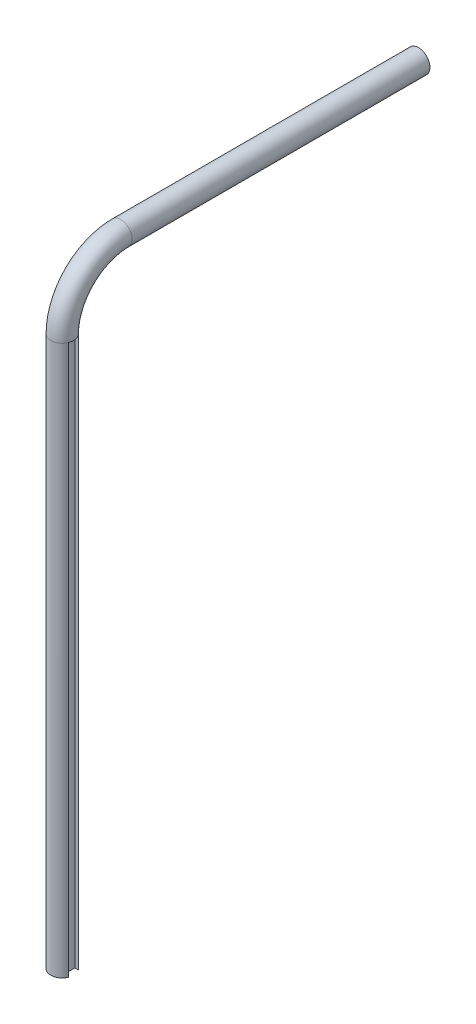
ISO-10303-21;
HEADER;
FILE_DESCRIPTION(('STEP AP214'),'2;1');
FILE_NAME('part.step','',(''),(''),'','','');
FILE_SCHEMA(('AUTOMOTIVE_DESIGN { 1 0 10303 214 1 1 1 1 }'));
ENDSEC;
DATA;
#1=APPLICATION_CONTEXT('core data for automotive mechanical design processes');
#2=APPLICATION_PROTOCOL_DEFINITION('international standard','automotive_design',2000,#1);
#3=PRODUCT_CONTEXT('',#1,'mechanical');
#4=PRODUCT('Part','Part','',(#3));
#5=PRODUCT_RELATED_PRODUCT_CATEGORY('part','',(#4));
#6=PRODUCT_DEFINITION_FORMATION('','',#4);
#7=PRODUCT_DEFINITION_CONTEXT('part definition',#1,'design');
#8=PRODUCT_DEFINITION('design','',#6,#7);
#9=PRODUCT_DEFINITION_SHAPE('','',#8);
#10=(LENGTH_UNIT() NAMED_UNIT(*) SI_UNIT(.MILLI.,.METRE.));
#11=(NAMED_UNIT(*) PLANE_ANGLE_UNIT() SI_UNIT($,.RADIAN.));
#12=(NAMED_UNIT(*) SI_UNIT($,.STERADIAN.) SOLID_ANGLE_UNIT());
#13=UNCERTAINTY_MEASURE_WITH_UNIT(LENGTH_MEASURE(1.E-05),#10,'distance_accuracy_value','');
#14=(GEOMETRIC_REPRESENTATION_CONTEXT(3) GLOBAL_UNCERTAINTY_ASSIGNED_CONTEXT((#13)) GLOBAL_UNIT_ASSIGNED_CONTEXT((#10,
#11,#12)) REPRESENTATION_CONTEXT('',''));
#15=CARTESIAN_POINT('',(0.,0.,0.));
#16=DIRECTION('',(0.,0.,1.));
#17=DIRECTION('',(1.,0.,0.));
#18=AXIS2_PLACEMENT_3D('',#15,#16,#17);
#19=CARTESIAN_POINT('',(0.,0.,0.));
#20=DIRECTION('',(-1.,0.,0.));
#21=DIRECTION('',(0.,0.,1.));
#22=AXIS2_PLACEMENT_3D('',#19,#20,#21);
#23=TOROIDAL_SURFACE('',#22,64.833774641659,12.7);
#24=CARTESIAN_POINT('',(0.,64.833774641659,0.));
#25=DIRECTION('',(0.,0.,-1.));
#26=DIRECTION('',(0.,1.,0.));
#27=AXIS2_PLACEMENT_3D('',#24,#25,#26);
#28=CIRCLE('',#27,12.7);
#29=CARTESIAN_POINT('',(0.,77.533774641659,0.));
#30=VERTEX_POINT('',#29);
#31=EDGE_CURVE('E132',#30,#30,#28,.T.);
#32=ORIENTED_EDGE('',*,*,#31,.F.);
#33=EDGE_LOOP('',(#32));
#34=FACE_BOUND('',#33,.T.);
#35=CARTESIAN_POINT('',(0.,0.,64.833774641659));
#36=DIRECTION('',(0.,-1.,0.));
#37=DIRECTION('',(0.,0.,-1.));
#38=AXIS2_PLACEMENT_3D('',#35,#36,#37);
#39=CIRCLE('',#38,12.7);
#40=CARTESIAN_POINT('',(10.1118547881285,0.,57.15));
#41=VERTEX_POINT('',#40);
#42=CARTESIAN_POINT('',(11.6673683045637,0.,69.85));
#43=VERTEX_POINT('',#42);
#44=EDGE_CURVE('E70',#41,#43,#39,.T.);
#45=ORIENTED_EDGE('',*,*,#44,.F.);
#46=EDGE_CURVE('E129',#43,#41,#39,.T.);
#47=ORIENTED_EDGE('',*,*,#46,.F.);
#48=EDGE_LOOP('',(#45,#47));
#49=FACE_BOUND('',#48,.T.);
#50=ADVANCED_FACE('F48',(#34,#49),#23,.T.);
#51=CARTESIAN_POINT('',(0.,0.,0.));
#52=DIRECTION('',(-1.,0.,0.));
#53=DIRECTION('',(0.,0.,1.));
#54=AXIS2_PLACEMENT_3D('',#51,#52,#53);
#55=TOROIDAL_SURFACE('',#54,64.833774641659,4.7625);
#56=CARTESIAN_POINT('',(0.,0.,64.833774641659));
#57=DIRECTION('',(0.,-1.,0.));
#58=DIRECTION('',(0.,0.,-1.));
#59=AXIS2_PLACEMENT_3D('',#56,#57,#58);
#60=CIRCLE('',#59,4.7625);
#61=CARTESIAN_POINT('',(0.,0.,69.596274641659));
#62=VERTEX_POINT('',#61);
#63=EDGE_CURVE('E125',#62,#62,#60,.T.);
#64=CARTESIAN_POINT('',(0.,64.833774641659,0.));
#65=DIRECTION('',(0.,0.,-1.));
#66=DIRECTION('',(0.,1.,0.));
#67=AXIS2_PLACEMENT_3D('',#64,#65,#66);
#68=CIRCLE('',#67,4.7625);
#69=CARTESIAN_POINT('',(0.,69.596274641659,0.));
#70=VERTEX_POINT('',#69);
#71=EDGE_CURVE('E138',#70,#70,#68,.F.);
#72=CARTESIAN_POINT('',(0.,0.,0.));
#73=DIRECTION('',(-1.,0.,0.));
#74=DIRECTION('',(0.,0.,1.));
#75=AXIS2_PLACEMENT_3D('',#72,#73,#74);
#76=CIRCLE('',#75,69.596274641659);
#77=EDGE_CURVE('',#62,#70,#76,.T.);
#78=ORIENTED_EDGE('',*,*,#63,.T.);
#79=ORIENTED_EDGE('',*,*,#71,.F.);
#80=ORIENTED_EDGE('',*,*,#77,.T.);
#81=ORIENTED_EDGE('',*,*,#77,.F.);
#82=EDGE_LOOP('',(#78,#80,#79,#81));
#83=FACE_BOUND('',#82,.T.);
#84=ADVANCED_FACE('F148',(#83),#55,.F.);
#85=CARTESIAN_POINT('',(0.,-609.6,64.833774641659));
#86=DIRECTION('',(0.,-1.,0.));
#87=DIRECTION('',(0.,0.,-1.));
#88=AXIS2_PLACEMENT_3D('',#85,#86,#87);
#89=PLANE('',#88);
#90=DIRECTION('',(1.,0.,0.));
#91=VECTOR('',#90,1.);
#92=CARTESIAN_POINT('',(6.35,-609.6,69.8499999999999));
#93=LINE('',#92,#91);
#94=CARTESIAN_POINT('',(6.35,-609.6,69.8499999999999));
#95=VERTEX_POINT('',#94);
#96=CARTESIAN_POINT('',(11.6673683045637,-609.6,69.8499999999999));
#97=VERTEX_POINT('',#96);
#98=EDGE_CURVE('E89',#95,#97,#93,.T.);
#99=ORIENTED_EDGE('',*,*,#98,.T.);
#100=CARTESIAN_POINT('',(0.,-609.6,64.833774641659));
#101=DIRECTION('',(0.,-1.,0.));
#102=DIRECTION('',(0.,0.,-1.));
#103=AXIS2_PLACEMENT_3D('',#100,#101,#102);
#104=CIRCLE('',#103,12.7);
#105=CARTESIAN_POINT('',(10.1118547881285,-609.6,57.1499999999999));
#106=VERTEX_POINT('',#105);
#107=EDGE_CURVE('E130',#97,#106,#104,.T.);
#108=ORIENTED_EDGE('',*,*,#107,.T.);
#109=DIRECTION('',(1.,0.,0.));
#110=VECTOR('',#109,1.);
#111=CARTESIAN_POINT('',(6.35,-609.6,57.1499999999999));
#112=LINE('',#111,#110);
#113=CARTESIAN_POINT('',(6.35,-609.6,57.1499999999999));
#114=VERTEX_POINT('',#113);
#115=EDGE_CURVE('E62',#114,#106,#112,.T.);
#116=ORIENTED_EDGE('',*,*,#115,.F.);
#117=DIRECTION('',(0.,0.,-1.));
#118=VECTOR('',#117,1.);
#119=CARTESIAN_POINT('',(6.35,-609.6,69.8499999999999));
#120=LINE('',#119,#118);
#121=EDGE_CURVE('E104',#95,#114,#120,.T.);
#122=ORIENTED_EDGE('',*,*,#121,.F.);
#123=EDGE_LOOP('',(#99,#108,#116,#122));
#124=FACE_BOUND('',#123,.T.);
#125=CARTESIAN_POINT('',(0.,-609.6,64.833774641659));
#126=DIRECTION('',(0.,-1.,0.));
#127=DIRECTION('',(0.,0.,-1.));
#128=AXIS2_PLACEMENT_3D('',#125,#126,#127);
#129=CIRCLE('',#128,4.7625);
#130=CARTESIAN_POINT('',(0.,-609.6,60.071274641659));
#131=VERTEX_POINT('',#130);
#132=EDGE_CURVE('E126',#131,#131,#129,.T.);
#133=ORIENTED_EDGE('',*,*,#132,.F.);
#134=EDGE_LOOP('',(#133));
#135=FACE_BOUND('',#134,.T.);
#136=ADVANCED_FACE('F107',(#124,#135),#89,.T.);
#137=CARTESIAN_POINT('',(0.,-609.6,64.833774641659));
#138=DIRECTION('',(0.,1.,0.));
#139=DIRECTION('',(0.,0.,1.));
#140=AXIS2_PLACEMENT_3D('',#137,#138,#139);
#141=CYLINDRICAL_SURFACE('',#140,12.7);
#142=ORIENTED_EDGE('',*,*,#107,.F.);
#143=DIRECTION('',(0.,1.,0.));
#144=VECTOR('',#143,1.);
#145=CARTESIAN_POINT('',(11.6673683045637,-609.6,69.8499999999999));
#146=LINE('',#145,#144);
#147=EDGE_CURVE('E13',#97,#43,#146,.T.);
#148=ORIENTED_EDGE('',*,*,#147,.T.);
#149=ORIENTED_EDGE('',*,*,#46,.T.);
#150=DIRECTION('',(0.,1.,0.));
#151=VECTOR('',#150,1.);
#152=CARTESIAN_POINT('',(10.1118547881285,-609.6,57.1499999999999));
#153=LINE('',#152,#151);
#154=EDGE_CURVE('E55',#41,#106,#153,.F.);
#155=ORIENTED_EDGE('',*,*,#154,.T.);
#156=EDGE_LOOP('',(#142,#148,#149,#155));
#157=FACE_BOUND('',#156,.T.);
#158=ADVANCED_FACE('F142',(#157),#141,.T.);
#159=CARTESIAN_POINT('',(0.,-609.6,64.833774641659));
#160=DIRECTION('',(0.,1.,0.));
#161=DIRECTION('',(0.,0.,1.));
#162=AXIS2_PLACEMENT_3D('',#159,#160,#161);
#163=CYLINDRICAL_SURFACE('',#162,4.7625);
#164=ORIENTED_EDGE('',*,*,#132,.T.);
#165=EDGE_LOOP('',(#164));
#166=FACE_BOUND('',#165,.T.);
#167=ORIENTED_EDGE('',*,*,#63,.F.);
#168=EDGE_LOOP('',(#167));
#169=FACE_BOUND('',#168,.T.);
#170=ADVANCED_FACE('F160',(#166,#169),#163,.F.);
#171=CARTESIAN_POINT('',(0.,64.833774641659,-330.2));
#172=DIRECTION('',(0.,0.,-1.));
#173=DIRECTION('',(0.,1.,0.));
#174=AXIS2_PLACEMENT_3D('',#171,#172,#173);
#175=PLANE('',#174);
#176=CARTESIAN_POINT('',(0.,64.833774641659,-330.2));
#177=DIRECTION('',(0.,0.,-1.));
#178=DIRECTION('',(0.,1.,0.));
#179=AXIS2_PLACEMENT_3D('',#176,#177,#178);
#180=CIRCLE('',#179,12.7);
#181=CARTESIAN_POINT('',(0.,77.533774641659,-330.2));
#182=VERTEX_POINT('',#181);
#183=EDGE_CURVE('E122',#182,#182,#180,.T.);
#184=ORIENTED_EDGE('',*,*,#183,.T.);
#185=EDGE_LOOP('',(#184));
#186=FACE_BOUND('',#185,.T.);
#187=CARTESIAN_POINT('',(0.,64.833774641659,-330.2));
#188=DIRECTION('',(0.,0.,-1.));
#189=DIRECTION('',(0.,1.,0.));
#190=AXIS2_PLACEMENT_3D('',#187,#188,#189);
#191=CIRCLE('',#190,4.7625);
#192=CARTESIAN_POINT('',(0.,69.596274641659,-330.2));
#193=VERTEX_POINT('',#192);
#194=EDGE_CURVE('E116',#193,#193,#191,.T.);
#195=ORIENTED_EDGE('',*,*,#194,.F.);
#196=EDGE_LOOP('',(#195));
#197=FACE_BOUND('',#196,.T.);
#198=ADVANCED_FACE('F165',(#186,#197),#175,.T.);
#199=CARTESIAN_POINT('',(0.,64.833774641659,-330.2));
#200=DIRECTION('',(0.,0.,1.));
#201=DIRECTION('',(0.,-1.,0.));
#202=AXIS2_PLACEMENT_3D('',#199,#200,#201);
#203=CYLINDRICAL_SURFACE('',#202,12.7);
#204=ORIENTED_EDGE('',*,*,#183,.F.);
#205=EDGE_LOOP('',(#204));
#206=FACE_BOUND('',#205,.T.);
#207=ORIENTED_EDGE('',*,*,#31,.T.);
#208=EDGE_LOOP('',(#207));
#209=FACE_BOUND('',#208,.T.);
#210=ADVANCED_FACE('F167',(#206,#209),#203,.T.);
#211=CARTESIAN_POINT('',(0.,64.833774641659,-330.2));
#212=DIRECTION('',(0.,0.,1.));
#213=DIRECTION('',(0.,-1.,0.));
#214=AXIS2_PLACEMENT_3D('',#211,#212,#213);
#215=CYLINDRICAL_SURFACE('',#214,4.7625);
#216=ORIENTED_EDGE('',*,*,#194,.T.);
#217=EDGE_LOOP('',(#216));
#218=FACE_BOUND('',#217,.T.);
#219=ORIENTED_EDGE('',*,*,#71,.T.);
#220=EDGE_LOOP('',(#219));
#221=FACE_BOUND('',#220,.T.);
#222=ADVANCED_FACE('F170',(#218,#221),#215,.F.);
#223=CARTESIAN_POINT('',(6.35,0.,69.85));
#224=DIRECTION('',(0.,0.,1.));
#225=DIRECTION('',(0.,-1.,0.));
#226=AXIS2_PLACEMENT_3D('',#223,#224,#225);
#227=PLANE('',#226);
#228=ORIENTED_EDGE('',*,*,#98,.F.);
#229=DIRECTION('',(0.,-1.,0.));
#230=VECTOR('',#229,1.);
#231=CARTESIAN_POINT('',(6.35,0.,69.85));
#232=LINE('',#231,#230);
#233=CARTESIAN_POINT('',(6.35,0.,69.85));
#234=VERTEX_POINT('',#233);
#235=EDGE_CURVE('E92',#234,#95,#232,.T.);
#236=ORIENTED_EDGE('',*,*,#235,.F.);
#237=DIRECTION('',(1.,0.,0.));
#238=VECTOR('',#237,1.);
#239=CARTESIAN_POINT('',(6.35,0.,69.85));
#240=LINE('',#239,#238);
#241=EDGE_CURVE('E114',#234,#43,#240,.T.);
#242=ORIENTED_EDGE('',*,*,#241,.T.);
#243=ORIENTED_EDGE('',*,*,#147,.F.);
#244=EDGE_LOOP('',(#228,#236,#242,#243));
#245=FACE_BOUND('',#244,.T.);
#246=ADVANCED_FACE('F91',(#245),#227,.F.);
#247=CARTESIAN_POINT('',(6.35,0.,69.85));
#248=DIRECTION('',(0.,1.,0.));
#249=DIRECTION('',(0.,0.,1.));
#250=AXIS2_PLACEMENT_3D('',#247,#248,#249);
#251=PLANE('',#250);
#252=ORIENTED_EDGE('',*,*,#241,.F.);
#253=DIRECTION('',(0.,0.,1.));
#254=VECTOR('',#253,1.);
#255=CARTESIAN_POINT('',(6.35,0.,69.85));
#256=LINE('',#255,#254);
#257=CARTESIAN_POINT('',(6.35,0.,57.15));
#258=VERTEX_POINT('',#257);
#259=EDGE_CURVE('E98',#258,#234,#256,.T.);
#260=ORIENTED_EDGE('',*,*,#259,.F.);
#261=DIRECTION('',(1.,0.,0.));
#262=VECTOR('',#261,1.);
#263=CARTESIAN_POINT('',(6.35,0.,57.15));
#264=LINE('',#263,#262);
#265=EDGE_CURVE('E117',#258,#41,#264,.T.);
#266=ORIENTED_EDGE('',*,*,#265,.T.);
#267=ORIENTED_EDGE('',*,*,#44,.T.);
#268=EDGE_LOOP('',(#252,#260,#266,#267));
#269=FACE_BOUND('',#268,.T.);
#270=ADVANCED_FACE('F145',(#269),#251,.F.);
#271=CARTESIAN_POINT('',(6.35,0.,57.15));
#272=DIRECTION('',(0.,0.,-1.));
#273=DIRECTION('',(0.,1.,0.));
#274=AXIS2_PLACEMENT_3D('',#271,#272,#273);
#275=PLANE('',#274);
#276=ORIENTED_EDGE('',*,*,#265,.F.);
#277=DIRECTION('',(0.,1.,0.));
#278=VECTOR('',#277,1.);
#279=CARTESIAN_POINT('',(6.35,0.,57.15));
#280=LINE('',#279,#278);
#281=EDGE_CURVE('E109',#114,#258,#280,.T.);
#282=ORIENTED_EDGE('',*,*,#281,.F.);
#283=ORIENTED_EDGE('',*,*,#115,.T.);
#284=ORIENTED_EDGE('',*,*,#154,.F.);
#285=EDGE_LOOP('',(#276,#282,#283,#284));
#286=FACE_BOUND('',#285,.T.);
#287=ADVANCED_FACE('F144',(#286),#275,.F.);
#288=CARTESIAN_POINT('',(6.35,0.,0.));
#289=DIRECTION('',(1.,0.,0.));
#290=DIRECTION('',(0.,0.,-1.));
#291=AXIS2_PLACEMENT_3D('',#288,#289,#290);
#292=PLANE('',#291);
#293=ORIENTED_EDGE('',*,*,#235,.T.);
#294=ORIENTED_EDGE('',*,*,#121,.T.);
#295=ORIENTED_EDGE('',*,*,#281,.T.);
#296=ORIENTED_EDGE('',*,*,#259,.T.);
#297=EDGE_LOOP('',(#293,#294,#295,#296));
#298=FACE_BOUND('',#297,.T.);
#299=ADVANCED_FACE('F102',(#298),#292,.T.);
#300=CLOSED_SHELL('',(#50,#84,#136,#158,#170,#198,#210,#222,#246,#270,#287,#299));
#301=MANIFOLD_SOLID_BREP('B2',#300);
#302=ADVANCED_BREP_SHAPE_REPRESENTATION('',(#18,#301),#14);
#303=SHAPE_DEFINITION_REPRESENTATION(#9,#302);
ENDSEC;
END-ISO-10303-21;
